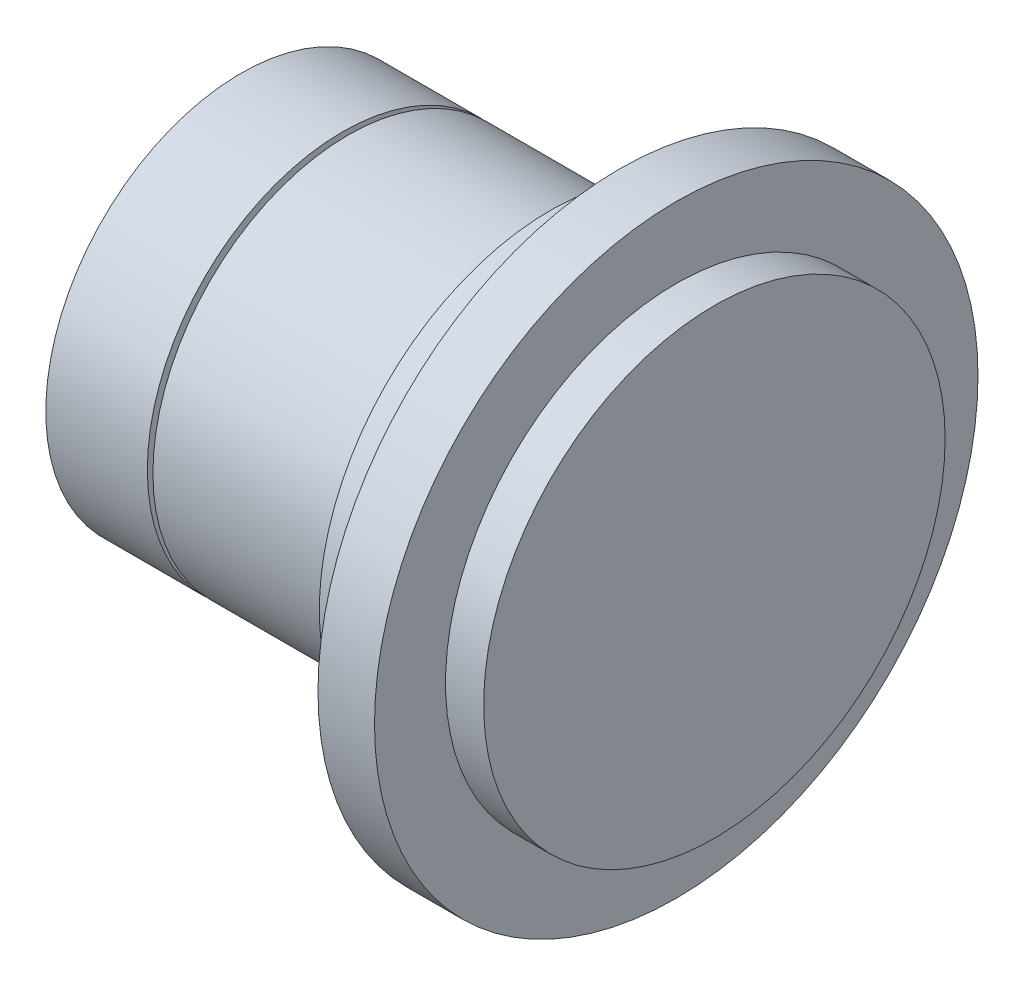
ISO-10303-21;
HEADER;
FILE_DESCRIPTION(('STEP AP214'),'2;1');
FILE_NAME('part.step','',(''),(''),'','','');
FILE_SCHEMA(('AUTOMOTIVE_DESIGN { 1 0 10303 214 1 1 1 1 }'));
ENDSEC;
DATA;
#1=APPLICATION_CONTEXT('core data for automotive mechanical design processes');
#2=APPLICATION_PROTOCOL_DEFINITION('international standard','automotive_design',2000,#1);
#3=PRODUCT_CONTEXT('',#1,'mechanical');
#4=PRODUCT('Part','Part','',(#3));
#5=PRODUCT_RELATED_PRODUCT_CATEGORY('part','',(#4));
#6=PRODUCT_DEFINITION_FORMATION('','',#4);
#7=PRODUCT_DEFINITION_CONTEXT('part definition',#1,'design');
#8=PRODUCT_DEFINITION('design','',#6,#7);
#9=PRODUCT_DEFINITION_SHAPE('','',#8);
#10=(LENGTH_UNIT() NAMED_UNIT(*) SI_UNIT(.MILLI.,.METRE.));
#11=(NAMED_UNIT(*) PLANE_ANGLE_UNIT() SI_UNIT($,.RADIAN.));
#12=(NAMED_UNIT(*) SI_UNIT($,.STERADIAN.) SOLID_ANGLE_UNIT());
#13=UNCERTAINTY_MEASURE_WITH_UNIT(LENGTH_MEASURE(1.E-05),#10,'distance_accuracy_value','');
#14=(GEOMETRIC_REPRESENTATION_CONTEXT(3) GLOBAL_UNCERTAINTY_ASSIGNED_CONTEXT((#13)) GLOBAL_UNIT_ASSIGNED_CONTEXT((#10,
#11,#12)) REPRESENTATION_CONTEXT('',''));
#15=CARTESIAN_POINT('',(0.,0.,0.));
#16=DIRECTION('',(0.,0.,1.));
#17=DIRECTION('',(1.,0.,0.));
#18=AXIS2_PLACEMENT_3D('',#15,#16,#17);
#19=CARTESIAN_POINT('',(0.,0.,0.));
#20=DIRECTION('',(1.,0.,0.));
#21=DIRECTION('',(0.,0.,-1.));
#22=AXIS2_PLACEMENT_3D('',#19,#20,#21);
#23=CYLINDRICAL_SURFACE('',#22,38.4685714285714);
#24=CARTESIAN_POINT('',(60.8761904761905,0.,0.));
#25=DIRECTION('',(1.,0.,0.));
#26=DIRECTION('',(0.,0.,-1.));
#27=AXIS2_PLACEMENT_3D('',#24,#25,#26);
#28=CIRCLE('',#27,38.4685714285714);
#29=CARTESIAN_POINT('',(60.8761904761905,0.,-38.4685714285714));
#30=VERTEX_POINT('',#29);
#31=EDGE_CURVE('E59',#30,#30,#28,.T.);
#32=ORIENTED_EDGE('',*,*,#31,.F.);
#33=EDGE_LOOP('',(#32));
#34=FACE_BOUND('',#33,.T.);
#35=CARTESIAN_POINT('',(21.1,0.,0.));
#36=DIRECTION('',(-1.,0.,0.));
#37=DIRECTION('',(0.,0.,1.));
#38=AXIS2_PLACEMENT_3D('',#35,#36,#37);
#39=CIRCLE('',#38,38.4685714285714);
#40=CARTESIAN_POINT('',(21.1,0.,38.4685714285714));
#41=VERTEX_POINT('',#40);
#42=EDGE_CURVE('E65',#41,#41,#39,.T.);
#43=ORIENTED_EDGE('',*,*,#42,.F.);
#44=EDGE_LOOP('',(#43));
#45=FACE_BOUND('',#44,.T.);
#46=ADVANCED_FACE('F33',(#34,#45),#23,.T.);
#47=CARTESIAN_POINT('',(93.2571428571429,0.,0.));
#48=DIRECTION('',(1.,0.,0.));
#49=DIRECTION('',(0.,0.,-1.));
#50=AXIS2_PLACEMENT_3D('',#47,#48,#49);
#51=PLANE('',#50);
#52=CARTESIAN_POINT('',(93.2571428571429,0.,0.));
#53=DIRECTION('',(1.,0.,0.));
#54=DIRECTION('',(0.,0.,-1.));
#55=AXIS2_PLACEMENT_3D('',#52,#53,#54);
#56=CIRCLE('',#55,45.4628571428572);
#57=CARTESIAN_POINT('',(93.2571428571429,0.,-45.4628571428572));
#58=VERTEX_POINT('',#57);
#59=EDGE_CURVE('E10',#58,#58,#56,.T.);
#60=ORIENTED_EDGE('',*,*,#59,.T.);
#61=EDGE_LOOP('',(#60));
#62=FACE_BOUND('',#61,.T.);
#63=ADVANCED_FACE('F90',(#62),#51,.T.);
#64=CARTESIAN_POINT('',(0.,0.,0.));
#65=DIRECTION('',(1.,0.,0.));
#66=DIRECTION('',(0.,0.,-1.));
#67=AXIS2_PLACEMENT_3D('',#64,#65,#66);
#68=CYLINDRICAL_SURFACE('',#67,45.4628571428572);
#69=CARTESIAN_POINT('',(85.7447619047619,0.,0.));
#70=DIRECTION('',(1.,0.,0.));
#71=DIRECTION('',(0.,0.,-1.));
#72=AXIS2_PLACEMENT_3D('',#69,#70,#71);
#73=CIRCLE('',#72,45.4628571428572);
#74=CARTESIAN_POINT('',(85.7447619047619,0.,-45.4628571428572));
#75=VERTEX_POINT('',#74);
#76=EDGE_CURVE('E40',#75,#75,#73,.T.);
#77=ORIENTED_EDGE('',*,*,#76,.T.);
#78=EDGE_LOOP('',(#77));
#79=FACE_BOUND('',#78,.T.);
#80=ORIENTED_EDGE('',*,*,#59,.F.);
#81=EDGE_LOOP('',(#80));
#82=FACE_BOUND('',#81,.T.);
#83=ADVANCED_FACE('F97',(#79,#82),#68,.T.);
#84=CARTESIAN_POINT('',(85.7447619047619,45.4628571428572,0.));
#85=DIRECTION('',(1.,0.,0.));
#86=DIRECTION('',(0.,0.,-1.));
#87=AXIS2_PLACEMENT_3D('',#84,#85,#86);
#88=PLANE('',#87);
#89=CARTESIAN_POINT('',(85.7447619047619,0.,0.));
#90=DIRECTION('',(1.,0.,0.));
#91=DIRECTION('',(0.,0.,-1.));
#92=AXIS2_PLACEMENT_3D('',#89,#90,#91);
#93=CIRCLE('',#92,59.4514285714286);
#94=CARTESIAN_POINT('',(85.7447619047619,0.,-59.4514285714286));
#95=VERTEX_POINT('',#94);
#96=EDGE_CURVE('E44',#95,#95,#93,.T.);
#97=ORIENTED_EDGE('',*,*,#96,.T.);
#98=EDGE_LOOP('',(#97));
#99=FACE_BOUND('',#98,.T.);
#100=ORIENTED_EDGE('',*,*,#76,.F.);
#101=EDGE_LOOP('',(#100));
#102=FACE_BOUND('',#101,.T.);
#103=ADVANCED_FACE('F139',(#99,#102),#88,.T.);
#104=CARTESIAN_POINT('',(0.,0.,0.));
#105=DIRECTION('',(1.,0.,0.));
#106=DIRECTION('',(0.,0.,-1.));
#107=AXIS2_PLACEMENT_3D('',#104,#105,#106);
#108=CYLINDRICAL_SURFACE('',#107,59.4514285714286);
#109=CARTESIAN_POINT('',(74.6057142857143,0.,0.));
#110=DIRECTION('',(1.,0.,0.));
#111=DIRECTION('',(0.,0.,-1.));
#112=AXIS2_PLACEMENT_3D('',#109,#110,#111);
#113=CIRCLE('',#112,59.4514285714286);
#114=CARTESIAN_POINT('',(74.6057142857143,0.,-59.4514285714286));
#115=VERTEX_POINT('',#114);
#116=EDGE_CURVE('E48',#115,#115,#113,.T.);
#117=ORIENTED_EDGE('',*,*,#116,.T.);
#118=EDGE_LOOP('',(#117));
#119=FACE_BOUND('',#118,.T.);
#120=ORIENTED_EDGE('',*,*,#96,.F.);
#121=EDGE_LOOP('',(#120));
#122=FACE_BOUND('',#121,.T.);
#123=ADVANCED_FACE('F148',(#119,#122),#108,.T.);
#124=CARTESIAN_POINT('',(74.6057142857143,59.4514285714286,0.));
#125=DIRECTION('',(-1.,0.,0.));
#126=DIRECTION('',(0.,0.,1.));
#127=AXIS2_PLACEMENT_3D('',#124,#125,#126);
#128=PLANE('',#127);
#129=CARTESIAN_POINT('',(74.6057142857143,0.,0.));
#130=DIRECTION('',(1.,0.,0.));
#131=DIRECTION('',(0.,0.,-1.));
#132=AXIS2_PLACEMENT_3D('',#129,#130,#131);
#133=CIRCLE('',#132,45.4628571428572);
#134=CARTESIAN_POINT('',(74.6057142857143,0.,-45.4628571428572));
#135=VERTEX_POINT('',#134);
#136=EDGE_CURVE('E53',#135,#135,#133,.T.);
#137=ORIENTED_EDGE('',*,*,#136,.T.);
#138=EDGE_LOOP('',(#137));
#139=FACE_BOUND('',#138,.T.);
#140=ORIENTED_EDGE('',*,*,#116,.F.);
#141=EDGE_LOOP('',(#140));
#142=FACE_BOUND('',#141,.T.);
#143=ADVANCED_FACE('F158',(#139,#142),#128,.T.);
#144=CARTESIAN_POINT('',(0.,0.,0.));
#145=DIRECTION('',(1.,0.,0.));
#146=DIRECTION('',(0.,0.,-1.));
#147=AXIS2_PLACEMENT_3D('',#144,#145,#146);
#148=CYLINDRICAL_SURFACE('',#147,45.4628571428572);
#149=CARTESIAN_POINT('',(60.8761904761905,0.,0.));
#150=DIRECTION('',(1.,0.,0.));
#151=DIRECTION('',(0.,0.,-1.));
#152=AXIS2_PLACEMENT_3D('',#149,#150,#151);
#153=CIRCLE('',#152,45.4628571428572);
#154=CARTESIAN_POINT('',(60.8761904761905,0.,-45.4628571428572));
#155=VERTEX_POINT('',#154);
#156=EDGE_CURVE('E56',#155,#155,#153,.T.);
#157=ORIENTED_EDGE('',*,*,#156,.T.);
#158=EDGE_LOOP('',(#157));
#159=FACE_BOUND('',#158,.T.);
#160=ORIENTED_EDGE('',*,*,#136,.F.);
#161=EDGE_LOOP('',(#160));
#162=FACE_BOUND('',#161,.T.);
#163=ADVANCED_FACE('F168',(#159,#162),#148,.T.);
#164=CARTESIAN_POINT('',(60.8761904761905,45.4628571428572,0.));
#165=DIRECTION('',(-1.,0.,0.));
#166=DIRECTION('',(0.,0.,1.));
#167=AXIS2_PLACEMENT_3D('',#164,#165,#166);
#168=PLANE('',#167);
#169=ORIENTED_EDGE('',*,*,#31,.T.);
#170=EDGE_LOOP('',(#169));
#171=FACE_BOUND('',#170,.T.);
#172=ORIENTED_EDGE('',*,*,#156,.F.);
#173=EDGE_LOOP('',(#172));
#174=FACE_BOUND('',#173,.T.);
#175=ADVANCED_FACE('F85',(#171,#174),#168,.T.);
#176=CARTESIAN_POINT('',(21.1,0.,0.));
#177=DIRECTION('',(-1.,0.,0.));
#178=DIRECTION('',(0.,0.,1.));
#179=AXIS2_PLACEMENT_3D('',#176,#177,#178);
#180=PLANE('',#179);
#181=CARTESIAN_POINT('',(21.1,0.,0.));
#182=DIRECTION('',(-1.,0.,0.));
#183=DIRECTION('',(0.,0.,1.));
#184=AXIS2_PLACEMENT_3D('',#181,#182,#183);
#185=CIRCLE('',#184,6.2);
#186=CARTESIAN_POINT('',(21.1,0.,6.2));
#187=VERTEX_POINT('',#186);
#188=EDGE_CURVE('E69',#187,#187,#185,.T.);
#189=ORIENTED_EDGE('',*,*,#188,.F.);
#190=EDGE_LOOP('',(#189));
#191=FACE_BOUND('',#190,.T.);
#192=ORIENTED_EDGE('',*,*,#42,.T.);
#193=EDGE_LOOP('',(#192));
#194=FACE_BOUND('',#193,.T.);
#195=ADVANCED_FACE('F81',(#191,#194),#180,.T.);
#196=CARTESIAN_POINT('',(20.,0.,0.));
#197=DIRECTION('',(-1.,0.,0.));
#198=DIRECTION('',(0.,0.,1.));
#199=AXIS2_PLACEMENT_3D('',#196,#197,#198);
#200=PLANE('',#199);
#201=CARTESIAN_POINT('',(20.,0.,0.));
#202=DIRECTION('',(-1.,0.,0.));
#203=DIRECTION('',(0.,0.,1.));
#204=AXIS2_PLACEMENT_3D('',#201,#202,#203);
#205=CIRCLE('',#204,6.2);
#206=CARTESIAN_POINT('',(20.,0.,6.2));
#207=VERTEX_POINT('',#206);
#208=EDGE_CURVE('E72',#207,#207,#205,.T.);
#209=ORIENTED_EDGE('',*,*,#208,.T.);
#210=EDGE_LOOP('',(#209));
#211=FACE_BOUND('',#210,.T.);
#212=CARTESIAN_POINT('',(20.,0.,0.));
#213=DIRECTION('',(-1.,0.,0.));
#214=DIRECTION('',(0.,0.,1.));
#215=AXIS2_PLACEMENT_3D('',#212,#213,#214);
#216=CIRCLE('',#215,38.4685714285714);
#217=CARTESIAN_POINT('',(20.,0.,38.4685714285714));
#218=VERTEX_POINT('',#217);
#219=EDGE_CURVE('E66',#218,#218,#216,.T.);
#220=ORIENTED_EDGE('',*,*,#219,.F.);
#221=EDGE_LOOP('',(#220));
#222=FACE_BOUND('',#221,.T.);
#223=ADVANCED_FACE('F84',(#211,#222),#200,.F.);
#224=CARTESIAN_POINT('',(21.1,0.,0.));
#225=DIRECTION('',(-1.,0.,0.));
#226=DIRECTION('',(0.,0.,1.));
#227=AXIS2_PLACEMENT_3D('',#224,#225,#226);
#228=CYLINDRICAL_SURFACE('',#227,6.2);
#229=ORIENTED_EDGE('',*,*,#188,.T.);
#230=EDGE_LOOP('',(#229));
#231=FACE_BOUND('',#230,.T.);
#232=ORIENTED_EDGE('',*,*,#208,.F.);
#233=EDGE_LOOP('',(#232));
#234=FACE_BOUND('',#233,.T.);
#235=ADVANCED_FACE('F78',(#231,#234),#228,.T.);
#236=CARTESIAN_POINT('',(0.,38.4685714285714,0.));
#237=DIRECTION('',(-1.,0.,0.));
#238=DIRECTION('',(0.,0.,1.));
#239=AXIS2_PLACEMENT_3D('',#236,#237,#238);
#240=PLANE('',#239);
#241=CARTESIAN_POINT('',(0.,0.,0.));
#242=DIRECTION('',(1.,0.,0.));
#243=DIRECTION('',(0.,0.,-1.));
#244=AXIS2_PLACEMENT_3D('',#241,#242,#243);
#245=CIRCLE('',#244,38.4685714285714);
#246=CARTESIAN_POINT('',(0.,0.,-38.4685714285714));
#247=VERTEX_POINT('',#246);
#248=EDGE_CURVE('E62',#247,#247,#245,.T.);
#249=ORIENTED_EDGE('',*,*,#248,.F.);
#250=EDGE_LOOP('',(#249));
#251=FACE_BOUND('',#250,.T.);
#252=ADVANCED_FACE('F35',(#251),#240,.T.);
#253=ORIENTED_EDGE('',*,*,#219,.T.);
#254=EDGE_LOOP('',(#253));
#255=FACE_BOUND('',#254,.T.);
#256=ORIENTED_EDGE('',*,*,#248,.T.);
#257=EDGE_LOOP('',(#256));
#258=FACE_BOUND('',#257,.T.);
#259=ADVANCED_FACE('F93',(#255,#258),#23,.T.);
#260=CLOSED_SHELL('',(#46,#63,#83,#103,#123,#143,#163,#175,#195,#223,#235,#252,#259));
#261=MANIFOLD_SOLID_BREP('B2',#260);
#262=ADVANCED_BREP_SHAPE_REPRESENTATION('',(#18,#261),#14);
#263=SHAPE_DEFINITION_REPRESENTATION(#9,#262);
ENDSEC;
END-ISO-10303-21;
